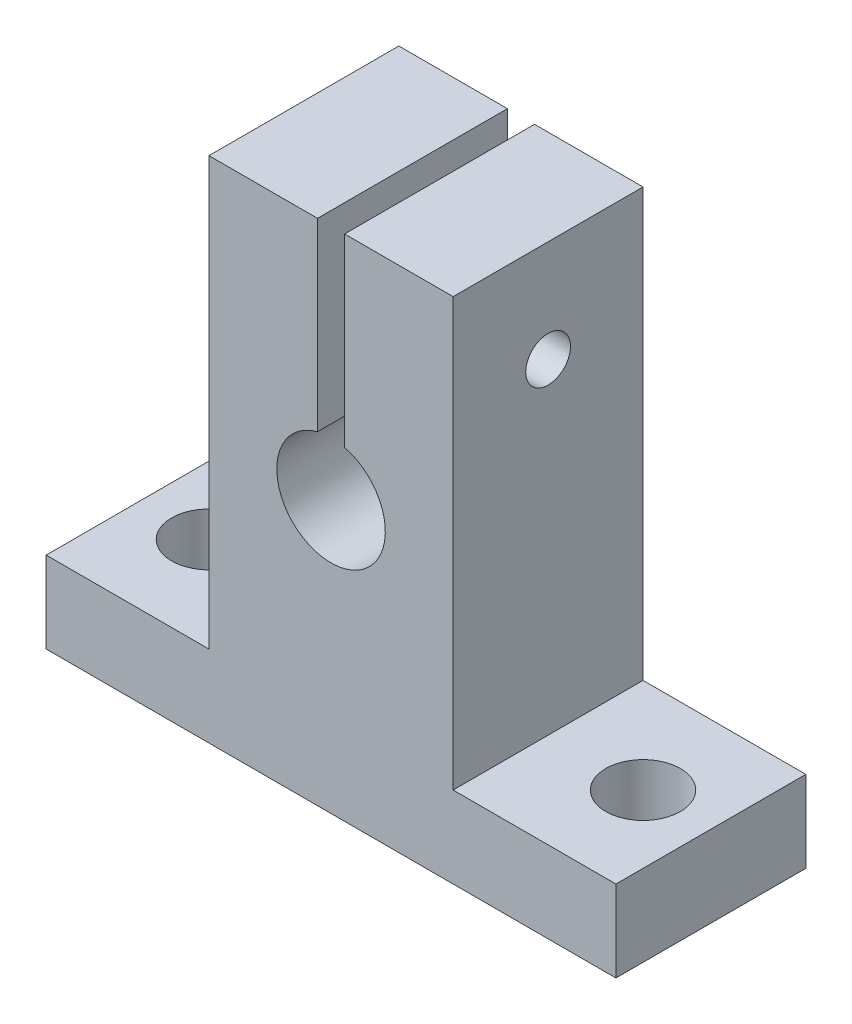
ISO-10303-21;
HEADER;
FILE_DESCRIPTION(('STEP AP214'),'2;1');
FILE_NAME('part.step','',(''),(''),'','','');
FILE_SCHEMA(('AUTOMOTIVE_DESIGN { 1 0 10303 214 1 1 1 1 }'));
ENDSEC;
DATA;
#1=APPLICATION_CONTEXT('core data for automotive mechanical design processes');
#2=APPLICATION_PROTOCOL_DEFINITION('international standard','automotive_design',2000,#1);
#3=PRODUCT_CONTEXT('',#1,'mechanical');
#4=PRODUCT('Part','Part','',(#3));
#5=PRODUCT_RELATED_PRODUCT_CATEGORY('part','',(#4));
#6=PRODUCT_DEFINITION_FORMATION('','',#4);
#7=PRODUCT_DEFINITION_CONTEXT('part definition',#1,'design');
#8=PRODUCT_DEFINITION('design','',#6,#7);
#9=PRODUCT_DEFINITION_SHAPE('','',#8);
#10=(LENGTH_UNIT() NAMED_UNIT(*) SI_UNIT(.MILLI.,.METRE.));
#11=(NAMED_UNIT(*) PLANE_ANGLE_UNIT() SI_UNIT($,.RADIAN.));
#12=(NAMED_UNIT(*) SI_UNIT($,.STERADIAN.) SOLID_ANGLE_UNIT());
#13=UNCERTAINTY_MEASURE_WITH_UNIT(LENGTH_MEASURE(1.E-05),#10,'distance_accuracy_value','');
#14=(GEOMETRIC_REPRESENTATION_CONTEXT(3) GLOBAL_UNCERTAINTY_ASSIGNED_CONTEXT((#13)) GLOBAL_UNIT_ASSIGNED_CONTEXT((#10,
#11,#12)) REPRESENTATION_CONTEXT('',''));
#15=CARTESIAN_POINT('',(0.,0.,0.));
#16=DIRECTION('',(0.,0.,1.));
#17=DIRECTION('',(1.,0.,0.));
#18=AXIS2_PLACEMENT_3D('',#15,#16,#17);
#19=CARTESIAN_POINT('',(-21.,-20.,14.));
#20=DIRECTION('',(0.,1.,0.));
#21=DIRECTION('',(0.,0.,1.));
#22=AXIS2_PLACEMENT_3D('',#19,#20,#21);
#23=PLANE('',#22);
#24=CARTESIAN_POINT('',(16.,-20.,7.));
#25=DIRECTION('',(0.,-1.,0.));
#26=DIRECTION('',(0.,0.,-1.));
#27=AXIS2_PLACEMENT_3D('',#24,#25,#26);
#28=CIRCLE('',#27,2.75);
#29=CARTESIAN_POINT('',(16.,-20.,4.25000000000001));
#30=VERTEX_POINT('',#29);
#31=EDGE_CURVE('E274',#30,#30,#28,.T.);
#32=ORIENTED_EDGE('',*,*,#31,.F.);
#33=EDGE_LOOP('',(#32));
#34=FACE_BOUND('',#33,.T.);
#35=CARTESIAN_POINT('',(-16.,-20.,7.));
#36=DIRECTION('',(0.,-1.,0.));
#37=DIRECTION('',(0.,0.,-1.));
#38=AXIS2_PLACEMENT_3D('',#35,#36,#37);
#39=CIRCLE('',#38,2.74999999999999);
#40=CARTESIAN_POINT('',(-16.,-20.,4.25000000000001));
#41=VERTEX_POINT('',#40);
#42=EDGE_CURVE('E277',#41,#41,#39,.T.);
#43=ORIENTED_EDGE('',*,*,#42,.F.);
#44=EDGE_LOOP('',(#43));
#45=FACE_BOUND('',#44,.T.);
#46=DIRECTION('',(1.,0.,0.));
#47=VECTOR('',#46,1.);
#48=CARTESIAN_POINT('',(-21.,-20.,0.));
#49=LINE('',#48,#47);
#50=CARTESIAN_POINT('',(-21.,-20.,0.));
#51=VERTEX_POINT('',#50);
#52=CARTESIAN_POINT('',(21.,-20.,0.));
#53=VERTEX_POINT('',#52);
#54=EDGE_CURVE('E122',#51,#53,#49,.T.);
#55=ORIENTED_EDGE('',*,*,#54,.T.);
#56=DIRECTION('',(0.,0.,-1.));
#57=VECTOR('',#56,1.);
#58=CARTESIAN_POINT('',(21.,-20.,14.));
#59=LINE('',#58,#57);
#60=CARTESIAN_POINT('',(21.,-20.,14.));
#61=VERTEX_POINT('',#60);
#62=EDGE_CURVE('E126',#61,#53,#59,.T.);
#63=ORIENTED_EDGE('',*,*,#62,.F.);
#64=DIRECTION('',(1.,0.,0.));
#65=VECTOR('',#64,1.);
#66=CARTESIAN_POINT('',(-21.,-20.,14.));
#67=LINE('',#66,#65);
#68=CARTESIAN_POINT('',(-21.,-20.,14.));
#69=VERTEX_POINT('',#68);
#70=EDGE_CURVE('E134',#69,#61,#67,.T.);
#71=ORIENTED_EDGE('',*,*,#70,.F.);
#72=DIRECTION('',(0.,0.,-1.));
#73=VECTOR('',#72,1.);
#74=CARTESIAN_POINT('',(-21.,-20.,14.));
#75=LINE('',#74,#73);
#76=EDGE_CURVE('E118',#69,#51,#75,.T.);
#77=ORIENTED_EDGE('',*,*,#76,.T.);
#78=EDGE_LOOP('',(#55,#63,#71,#77));
#79=FACE_BOUND('',#78,.T.);
#80=ADVANCED_FACE('F32',(#34,#45,#79),#23,.F.);
#81=CARTESIAN_POINT('',(-1.,0.,14.));
#82=DIRECTION('',(-1.,0.,0.));
#83=DIRECTION('',(0.,0.,1.));
#84=AXIS2_PLACEMENT_3D('',#81,#82,#83);
#85=PLANE('',#84);
#86=CARTESIAN_POINT('',(-0.999999999999999,10.,7.));
#87=DIRECTION('',(-1.,0.,0.));
#88=DIRECTION('',(0.,0.,1.));
#89=AXIS2_PLACEMENT_3D('',#86,#87,#88);
#90=CIRCLE('',#89,1.64999999999999);
#91=CARTESIAN_POINT('',(-0.999999999999999,10.,8.64999999999999));
#92=VERTEX_POINT('',#91);
#93=EDGE_CURVE('E147',#92,#92,#90,.T.);
#94=ORIENTED_EDGE('',*,*,#93,.T.);
#95=EDGE_LOOP('',(#94));
#96=FACE_BOUND('',#95,.T.);
#97=DIRECTION('',(0.,1.,0.));
#98=VECTOR('',#97,1.);
#99=CARTESIAN_POINT('',(-1.,0.,14.));
#100=LINE('',#99,#98);
#101=CARTESIAN_POINT('',(-1.,3.87298334620741,14.));
#102=VERTEX_POINT('',#101);
#103=CARTESIAN_POINT('',(-1.,17.5,14.));
#104=VERTEX_POINT('',#103);
#105=EDGE_CURVE('E86',#102,#104,#100,.T.);
#106=ORIENTED_EDGE('',*,*,#105,.F.);
#107=DIRECTION('',(0.,0.,-1.));
#108=VECTOR('',#107,1.);
#109=CARTESIAN_POINT('',(-1.,3.87298334620741,0.));
#110=LINE('',#109,#108);
#111=CARTESIAN_POINT('',(-1.,3.87298334620742,0.));
#112=VERTEX_POINT('',#111);
#113=EDGE_CURVE('E150',#102,#112,#110,.T.);
#114=ORIENTED_EDGE('',*,*,#113,.T.);
#115=DIRECTION('',(0.,1.,0.));
#116=VECTOR('',#115,1.);
#117=CARTESIAN_POINT('',(-1.,0.,0.));
#118=LINE('',#117,#116);
#119=CARTESIAN_POINT('',(-1.,17.5,0.));
#120=VERTEX_POINT('',#119);
#121=EDGE_CURVE('E125',#112,#120,#118,.T.);
#122=ORIENTED_EDGE('',*,*,#121,.T.);
#123=DIRECTION('',(0.,0.,-1.));
#124=VECTOR('',#123,1.);
#125=CARTESIAN_POINT('',(-1.,17.5,14.));
#126=LINE('',#125,#124);
#127=EDGE_CURVE('E40',#104,#120,#126,.T.);
#128=ORIENTED_EDGE('',*,*,#127,.F.);
#129=EDGE_LOOP('',(#106,#114,#122,#128));
#130=FACE_BOUND('',#129,.T.);
#131=ADVANCED_FACE('F264',(#96,#130),#85,.F.);
#132=CARTESIAN_POINT('',(-1.,17.5,14.));
#133=DIRECTION('',(0.,-1.,0.));
#134=DIRECTION('',(0.,0.,-1.));
#135=AXIS2_PLACEMENT_3D('',#132,#133,#134);
#136=PLANE('',#135);
#137=DIRECTION('',(-1.,0.,0.));
#138=VECTOR('',#137,1.);
#139=CARTESIAN_POINT('',(-1.,17.5,0.));
#140=LINE('',#139,#138);
#141=CARTESIAN_POINT('',(-9.,17.5,0.));
#142=VERTEX_POINT('',#141);
#143=EDGE_CURVE('E128',#120,#142,#140,.T.);
#144=ORIENTED_EDGE('',*,*,#143,.T.);
#145=DIRECTION('',(0.,0.,-1.));
#146=VECTOR('',#145,1.);
#147=CARTESIAN_POINT('',(-9.,17.5,14.));
#148=LINE('',#147,#146);
#149=CARTESIAN_POINT('',(-9.,17.5,14.));
#150=VERTEX_POINT('',#149);
#151=EDGE_CURVE('E113',#150,#142,#148,.T.);
#152=ORIENTED_EDGE('',*,*,#151,.F.);
#153=DIRECTION('',(-1.,0.,0.));
#154=VECTOR('',#153,1.);
#155=CARTESIAN_POINT('',(-1.,17.5,14.));
#156=LINE('',#155,#154);
#157=EDGE_CURVE('E101',#104,#150,#156,.T.);
#158=ORIENTED_EDGE('',*,*,#157,.F.);
#159=ORIENTED_EDGE('',*,*,#127,.T.);
#160=EDGE_LOOP('',(#144,#152,#158,#159));
#161=FACE_BOUND('',#160,.T.);
#162=ADVANCED_FACE('F269',(#161),#136,.F.);
#163=CARTESIAN_POINT('',(-9.,17.5,14.));
#164=DIRECTION('',(1.,0.,0.));
#165=DIRECTION('',(0.,1.,0.));
#166=AXIS2_PLACEMENT_3D('',#163,#164,#165);
#167=PLANE('',#166);
#168=CARTESIAN_POINT('',(-9.,10.,7.));
#169=DIRECTION('',(-1.,0.,0.));
#170=DIRECTION('',(0.,0.,1.));
#171=AXIS2_PLACEMENT_3D('',#168,#169,#170);
#172=CIRCLE('',#171,1.64999999999999);
#173=CARTESIAN_POINT('',(-9.,10.,8.64999999999999));
#174=VERTEX_POINT('',#173);
#175=EDGE_CURVE('E143',#174,#174,#172,.T.);
#176=ORIENTED_EDGE('',*,*,#175,.F.);
#177=EDGE_LOOP('',(#176));
#178=FACE_BOUND('',#177,.T.);
#179=DIRECTION('',(0.,-1.,0.));
#180=VECTOR('',#179,1.);
#181=CARTESIAN_POINT('',(-9.,17.5,0.));
#182=LINE('',#181,#180);
#183=CARTESIAN_POINT('',(-9.,-14.,0.));
#184=VERTEX_POINT('',#183);
#185=EDGE_CURVE('E110',#142,#184,#182,.T.);
#186=ORIENTED_EDGE('',*,*,#185,.T.);
#187=DIRECTION('',(0.,0.,-1.));
#188=VECTOR('',#187,1.);
#189=CARTESIAN_POINT('',(-9.,-14.,14.));
#190=LINE('',#189,#188);
#191=CARTESIAN_POINT('',(-9.,-14.,14.));
#192=VERTEX_POINT('',#191);
#193=EDGE_CURVE('E107',#192,#184,#190,.T.);
#194=ORIENTED_EDGE('',*,*,#193,.F.);
#195=DIRECTION('',(0.,-1.,0.));
#196=VECTOR('',#195,1.);
#197=CARTESIAN_POINT('',(-9.,17.5,14.));
#198=LINE('',#197,#196);
#199=EDGE_CURVE('E94',#150,#192,#198,.T.);
#200=ORIENTED_EDGE('',*,*,#199,.F.);
#201=ORIENTED_EDGE('',*,*,#151,.T.);
#202=EDGE_LOOP('',(#186,#194,#200,#201));
#203=FACE_BOUND('',#202,.T.);
#204=ADVANCED_FACE('F108',(#178,#203),#167,.F.);
#205=CARTESIAN_POINT('',(-9.,-14.,14.));
#206=DIRECTION('',(0.,-1.,0.));
#207=DIRECTION('',(1.,0.,0.));
#208=AXIS2_PLACEMENT_3D('',#205,#206,#207);
#209=PLANE('',#208);
#210=CARTESIAN_POINT('',(-16.,-14.,7.));
#211=DIRECTION('',(0.,-1.,0.));
#212=DIRECTION('',(1.,0.,0.));
#213=AXIS2_PLACEMENT_3D('',#210,#211,#212);
#214=CIRCLE('',#213,2.74999999999999);
#215=CARTESIAN_POINT('',(-13.25,-14.,7.));
#216=VERTEX_POINT('',#215);
#217=EDGE_CURVE('E279',#216,#216,#214,.T.);
#218=ORIENTED_EDGE('',*,*,#217,.T.);
#219=EDGE_LOOP('',(#218));
#220=FACE_BOUND('',#219,.T.);
#221=DIRECTION('',(-1.,0.,0.));
#222=VECTOR('',#221,1.);
#223=CARTESIAN_POINT('',(-9.,-14.,0.));
#224=LINE('',#223,#222);
#225=CARTESIAN_POINT('',(-21.,-14.,0.));
#226=VERTEX_POINT('',#225);
#227=EDGE_CURVE('E131',#184,#226,#224,.T.);
#228=ORIENTED_EDGE('',*,*,#227,.T.);
#229=DIRECTION('',(0.,0.,-1.));
#230=VECTOR('',#229,1.);
#231=CARTESIAN_POINT('',(-21.,-14.,14.));
#232=LINE('',#231,#230);
#233=CARTESIAN_POINT('',(-21.,-14.,14.));
#234=VERTEX_POINT('',#233);
#235=EDGE_CURVE('E114',#234,#226,#232,.T.);
#236=ORIENTED_EDGE('',*,*,#235,.F.);
#237=DIRECTION('',(-1.,0.,0.));
#238=VECTOR('',#237,1.);
#239=CARTESIAN_POINT('',(-9.,-14.,14.));
#240=LINE('',#239,#238);
#241=EDGE_CURVE('E98',#192,#234,#240,.T.);
#242=ORIENTED_EDGE('',*,*,#241,.F.);
#243=ORIENTED_EDGE('',*,*,#193,.T.);
#244=EDGE_LOOP('',(#228,#236,#242,#243));
#245=FACE_BOUND('',#244,.T.);
#246=ADVANCED_FACE('F116',(#220,#245),#209,.F.);
#247=CARTESIAN_POINT('',(-21.,-14.,14.));
#248=DIRECTION('',(1.,0.,0.));
#249=DIRECTION('',(0.,0.,-1.));
#250=AXIS2_PLACEMENT_3D('',#247,#248,#249);
#251=PLANE('',#250);
#252=DIRECTION('',(0.,-1.,0.));
#253=VECTOR('',#252,1.);
#254=CARTESIAN_POINT('',(-21.,-14.,0.));
#255=LINE('',#254,#253);
#256=EDGE_CURVE('E79',#226,#51,#255,.T.);
#257=ORIENTED_EDGE('',*,*,#256,.T.);
#258=ORIENTED_EDGE('',*,*,#76,.F.);
#259=DIRECTION('',(0.,-1.,0.));
#260=VECTOR('',#259,1.);
#261=CARTESIAN_POINT('',(-21.,-14.,14.));
#262=LINE('',#261,#260);
#263=EDGE_CURVE('E55',#234,#69,#262,.T.);
#264=ORIENTED_EDGE('',*,*,#263,.F.);
#265=ORIENTED_EDGE('',*,*,#235,.T.);
#266=EDGE_LOOP('',(#257,#258,#264,#265));
#267=FACE_BOUND('',#266,.T.);
#268=ADVANCED_FACE('F291',(#267),#251,.F.);
#269=CARTESIAN_POINT('',(0.,0.,14.));
#270=DIRECTION('',(0.,0.,1.));
#271=DIRECTION('',(1.,0.,0.));
#272=AXIS2_PLACEMENT_3D('',#269,#270,#271);
#273=PLANE('',#272);
#274=CARTESIAN_POINT('',(0.,0.,14.));
#275=DIRECTION('',(0.,0.,-1.));
#276=DIRECTION('',(-1.,0.,0.));
#277=AXIS2_PLACEMENT_3D('',#274,#275,#276);
#278=CIRCLE('',#277,4.);
#279=CARTESIAN_POINT('',(1.,3.87298334620741,14.));
#280=VERTEX_POINT('',#279);
#281=EDGE_CURVE('E46',#280,#102,#278,.T.);
#282=ORIENTED_EDGE('',*,*,#281,.T.);
#283=ORIENTED_EDGE('',*,*,#105,.T.);
#284=ORIENTED_EDGE('',*,*,#157,.T.);
#285=ORIENTED_EDGE('',*,*,#199,.T.);
#286=ORIENTED_EDGE('',*,*,#241,.T.);
#287=ORIENTED_EDGE('',*,*,#263,.T.);
#288=ORIENTED_EDGE('',*,*,#70,.T.);
#289=DIRECTION('',(0.,-1.,0.));
#290=VECTOR('',#289,1.);
#291=CARTESIAN_POINT('',(21.,-14.,14.));
#292=LINE('',#291,#290);
#293=CARTESIAN_POINT('',(21.,-14.,14.));
#294=VERTEX_POINT('',#293);
#295=EDGE_CURVE('E161',#294,#61,#292,.T.);
#296=ORIENTED_EDGE('',*,*,#295,.F.);
#297=DIRECTION('',(1.,0.,0.));
#298=VECTOR('',#297,1.);
#299=CARTESIAN_POINT('',(9.,-14.,14.));
#300=LINE('',#299,#298);
#301=CARTESIAN_POINT('',(9.,-14.,14.));
#302=VERTEX_POINT('',#301);
#303=EDGE_CURVE('E164',#302,#294,#300,.T.);
#304=ORIENTED_EDGE('',*,*,#303,.F.);
#305=DIRECTION('',(0.,-1.,0.));
#306=VECTOR('',#305,1.);
#307=CARTESIAN_POINT('',(9.,17.5,14.));
#308=LINE('',#307,#306);
#309=CARTESIAN_POINT('',(9.,17.5,14.));
#310=VERTEX_POINT('',#309);
#311=EDGE_CURVE('E168',#310,#302,#308,.T.);
#312=ORIENTED_EDGE('',*,*,#311,.F.);
#313=DIRECTION('',(1.,0.,0.));
#314=VECTOR('',#313,1.);
#315=CARTESIAN_POINT('',(1.,17.5,14.));
#316=LINE('',#315,#314);
#317=CARTESIAN_POINT('',(1.,17.5,14.));
#318=VERTEX_POINT('',#317);
#319=EDGE_CURVE('E171',#318,#310,#316,.T.);
#320=ORIENTED_EDGE('',*,*,#319,.F.);
#321=DIRECTION('',(0.,1.,0.));
#322=VECTOR('',#321,1.);
#323=CARTESIAN_POINT('',(1.,0.,14.));
#324=LINE('',#323,#322);
#325=EDGE_CURVE('E174',#280,#318,#324,.T.);
#326=ORIENTED_EDGE('',*,*,#325,.F.);
#327=EDGE_LOOP('',(#282,#283,#284,#285,#286,#287,#288,#296,#304,#312,#320,#326));
#328=FACE_BOUND('',#327,.T.);
#329=ADVANCED_FACE('F96',(#328),#273,.T.);
#330=CARTESIAN_POINT('',(0.,0.,0.));
#331=DIRECTION('',(0.,0.,1.));
#332=DIRECTION('',(1.,0.,0.));
#333=AXIS2_PLACEMENT_3D('',#330,#331,#332);
#334=PLANE('',#333);
#335=ORIENTED_EDGE('',*,*,#121,.F.);
#336=CARTESIAN_POINT('',(0.,0.,0.));
#337=DIRECTION('',(0.,0.,-1.));
#338=DIRECTION('',(-1.,0.,0.));
#339=AXIS2_PLACEMENT_3D('',#336,#337,#338);
#340=CIRCLE('',#339,4.);
#341=CARTESIAN_POINT('',(1.,3.87298334620742,0.));
#342=VERTEX_POINT('',#341);
#343=EDGE_CURVE('E244',#342,#112,#340,.T.);
#344=ORIENTED_EDGE('',*,*,#343,.F.);
#345=DIRECTION('',(0.,1.,0.));
#346=VECTOR('',#345,1.);
#347=CARTESIAN_POINT('',(1.,0.,0.));
#348=LINE('',#347,#346);
#349=CARTESIAN_POINT('',(1.,17.5,0.));
#350=VERTEX_POINT('',#349);
#351=EDGE_CURVE('E165',#342,#350,#348,.T.);
#352=ORIENTED_EDGE('',*,*,#351,.T.);
#353=DIRECTION('',(1.,0.,0.));
#354=VECTOR('',#353,1.);
#355=CARTESIAN_POINT('',(1.,17.5,0.));
#356=LINE('',#355,#354);
#357=CARTESIAN_POINT('',(9.,17.5,0.));
#358=VERTEX_POINT('',#357);
#359=EDGE_CURVE('E186',#350,#358,#356,.T.);
#360=ORIENTED_EDGE('',*,*,#359,.T.);
#361=DIRECTION('',(0.,-1.,0.));
#362=VECTOR('',#361,1.);
#363=CARTESIAN_POINT('',(9.,17.5,0.));
#364=LINE('',#363,#362);
#365=CARTESIAN_POINT('',(9.,-14.,0.));
#366=VERTEX_POINT('',#365);
#367=EDGE_CURVE('E183',#358,#366,#364,.T.);
#368=ORIENTED_EDGE('',*,*,#367,.T.);
#369=DIRECTION('',(1.,0.,0.));
#370=VECTOR('',#369,1.);
#371=CARTESIAN_POINT('',(9.,-14.,0.));
#372=LINE('',#371,#370);
#373=CARTESIAN_POINT('',(21.,-14.,0.));
#374=VERTEX_POINT('',#373);
#375=EDGE_CURVE('E180',#366,#374,#372,.T.);
#376=ORIENTED_EDGE('',*,*,#375,.T.);
#377=DIRECTION('',(0.,-1.,0.));
#378=VECTOR('',#377,1.);
#379=CARTESIAN_POINT('',(21.,-14.,0.));
#380=LINE('',#379,#378);
#381=EDGE_CURVE('E160',#374,#53,#380,.T.);
#382=ORIENTED_EDGE('',*,*,#381,.T.);
#383=ORIENTED_EDGE('',*,*,#54,.F.);
#384=ORIENTED_EDGE('',*,*,#256,.F.);
#385=ORIENTED_EDGE('',*,*,#227,.F.);
#386=ORIENTED_EDGE('',*,*,#185,.F.);
#387=ORIENTED_EDGE('',*,*,#143,.F.);
#388=EDGE_LOOP('',(#335,#344,#352,#360,#368,#376,#382,#383,#384,#385,#386,#387));
#389=FACE_BOUND('',#388,.T.);
#390=ADVANCED_FACE('F241',(#389),#334,.F.);
#391=CARTESIAN_POINT('',(21.,-14.,14.));
#392=DIRECTION('',(1.,0.,0.));
#393=DIRECTION('',(0.,0.,-1.));
#394=AXIS2_PLACEMENT_3D('',#391,#392,#393);
#395=PLANE('',#394);
#396=ORIENTED_EDGE('',*,*,#381,.F.);
#397=DIRECTION('',(0.,0.,-1.));
#398=VECTOR('',#397,1.);
#399=CARTESIAN_POINT('',(21.,-14.,14.));
#400=LINE('',#399,#398);
#401=EDGE_CURVE('E199',#294,#374,#400,.T.);
#402=ORIENTED_EDGE('',*,*,#401,.F.);
#403=ORIENTED_EDGE('',*,*,#295,.T.);
#404=ORIENTED_EDGE('',*,*,#62,.T.);
#405=EDGE_LOOP('',(#396,#402,#403,#404));
#406=FACE_BOUND('',#405,.T.);
#407=ADVANCED_FACE('F218',(#406),#395,.T.);
#408=CARTESIAN_POINT('',(9.,-14.,14.));
#409=DIRECTION('',(0.,1.,0.));
#410=DIRECTION('',(-1.,0.,0.));
#411=AXIS2_PLACEMENT_3D('',#408,#409,#410);
#412=PLANE('',#411);
#413=CARTESIAN_POINT('',(16.,-14.,7.));
#414=DIRECTION('',(0.,1.,0.));
#415=DIRECTION('',(-1.,0.,0.));
#416=AXIS2_PLACEMENT_3D('',#413,#414,#415);
#417=CIRCLE('',#416,2.74999999999999);
#418=CARTESIAN_POINT('',(13.25,-14.,7.));
#419=VERTEX_POINT('',#418);
#420=EDGE_CURVE('E35',#419,#419,#417,.T.);
#421=ORIENTED_EDGE('',*,*,#420,.F.);
#422=EDGE_LOOP('',(#421));
#423=FACE_BOUND('',#422,.T.);
#424=ORIENTED_EDGE('',*,*,#375,.F.);
#425=DIRECTION('',(0.,0.,-1.));
#426=VECTOR('',#425,1.);
#427=CARTESIAN_POINT('',(9.,-14.,14.));
#428=LINE('',#427,#426);
#429=EDGE_CURVE('E196',#302,#366,#428,.T.);
#430=ORIENTED_EDGE('',*,*,#429,.F.);
#431=ORIENTED_EDGE('',*,*,#303,.T.);
#432=ORIENTED_EDGE('',*,*,#401,.T.);
#433=EDGE_LOOP('',(#424,#430,#431,#432));
#434=FACE_BOUND('',#433,.T.);
#435=ADVANCED_FACE('F224',(#423,#434),#412,.T.);
#436=CARTESIAN_POINT('',(9.,17.5,14.));
#437=DIRECTION('',(1.,0.,0.));
#438=DIRECTION('',(0.,1.,0.));
#439=AXIS2_PLACEMENT_3D('',#436,#437,#438);
#440=PLANE('',#439);
#441=CARTESIAN_POINT('',(9.,10.,7.));
#442=DIRECTION('',(1.,0.,0.));
#443=DIRECTION('',(0.,1.,0.));
#444=AXIS2_PLACEMENT_3D('',#441,#442,#443);
#445=CIRCLE('',#444,1.64999999999999);
#446=CARTESIAN_POINT('',(9.,11.65,7.));
#447=VERTEX_POINT('',#446);
#448=EDGE_CURVE('E142',#447,#447,#445,.T.);
#449=ORIENTED_EDGE('',*,*,#448,.F.);
#450=EDGE_LOOP('',(#449));
#451=FACE_BOUND('',#450,.T.);
#452=ORIENTED_EDGE('',*,*,#367,.F.);
#453=DIRECTION('',(0.,0.,-1.));
#454=VECTOR('',#453,1.);
#455=CARTESIAN_POINT('',(9.,17.5,14.));
#456=LINE('',#455,#454);
#457=EDGE_CURVE('E193',#310,#358,#456,.T.);
#458=ORIENTED_EDGE('',*,*,#457,.F.);
#459=ORIENTED_EDGE('',*,*,#311,.T.);
#460=ORIENTED_EDGE('',*,*,#429,.T.);
#461=EDGE_LOOP('',(#452,#458,#459,#460));
#462=FACE_BOUND('',#461,.T.);
#463=ADVANCED_FACE('F253',(#451,#462),#440,.T.);
#464=CARTESIAN_POINT('',(1.,17.5,14.));
#465=DIRECTION('',(0.,1.,0.));
#466=DIRECTION('',(0.,0.,1.));
#467=AXIS2_PLACEMENT_3D('',#464,#465,#466);
#468=PLANE('',#467);
#469=ORIENTED_EDGE('',*,*,#359,.F.);
#470=DIRECTION('',(0.,0.,-1.));
#471=VECTOR('',#470,1.);
#472=CARTESIAN_POINT('',(1.,17.5,14.));
#473=LINE('',#472,#471);
#474=EDGE_CURVE('E177',#318,#350,#473,.T.);
#475=ORIENTED_EDGE('',*,*,#474,.F.);
#476=ORIENTED_EDGE('',*,*,#319,.T.);
#477=ORIENTED_EDGE('',*,*,#457,.T.);
#478=EDGE_LOOP('',(#469,#475,#476,#477));
#479=FACE_BOUND('',#478,.T.);
#480=ADVANCED_FACE('F251',(#479),#468,.T.);
#481=CARTESIAN_POINT('',(1.,0.,14.));
#482=DIRECTION('',(-1.,0.,0.));
#483=DIRECTION('',(0.,0.,1.));
#484=AXIS2_PLACEMENT_3D('',#481,#482,#483);
#485=PLANE('',#484);
#486=DIRECTION('',(0.,0.,-1.));
#487=VECTOR('',#486,1.);
#488=CARTESIAN_POINT('',(1.,3.87298334620741,0.));
#489=LINE('',#488,#487);
#490=EDGE_CURVE('E11',#280,#342,#489,.T.);
#491=ORIENTED_EDGE('',*,*,#490,.F.);
#492=ORIENTED_EDGE('',*,*,#325,.T.);
#493=ORIENTED_EDGE('',*,*,#474,.T.);
#494=ORIENTED_EDGE('',*,*,#351,.F.);
#495=EDGE_LOOP('',(#491,#492,#493,#494));
#496=FACE_BOUND('',#495,.T.);
#497=CARTESIAN_POINT('',(0.999999999999999,10.,7.));
#498=DIRECTION('',(-1.,0.,0.));
#499=DIRECTION('',(0.,0.,1.));
#500=AXIS2_PLACEMENT_3D('',#497,#498,#499);
#501=CIRCLE('',#500,1.64999999999999);
#502=CARTESIAN_POINT('',(0.999999999999999,10.,8.64999999999999));
#503=VERTEX_POINT('',#502);
#504=EDGE_CURVE('E140',#503,#503,#501,.T.);
#505=ORIENTED_EDGE('',*,*,#504,.F.);
#506=EDGE_LOOP('',(#505));
#507=FACE_BOUND('',#506,.T.);
#508=ADVANCED_FACE('F247',(#496,#507),#485,.T.);
#509=CARTESIAN_POINT('',(-9.,10.,7.));
#510=DIRECTION('',(-1.,0.,0.));
#511=DIRECTION('',(0.,0.,1.));
#512=AXIS2_PLACEMENT_3D('',#509,#510,#511);
#513=CYLINDRICAL_SURFACE('',#512,1.64999999999999);
#514=ORIENTED_EDGE('',*,*,#448,.T.);
#515=EDGE_LOOP('',(#514));
#516=FACE_BOUND('',#515,.T.);
#517=ORIENTED_EDGE('',*,*,#504,.T.);
#518=EDGE_LOOP('',(#517));
#519=FACE_BOUND('',#518,.T.);
#520=ADVANCED_FACE('F259',(#516,#519),#513,.F.);
#521=ORIENTED_EDGE('',*,*,#175,.T.);
#522=EDGE_LOOP('',(#521));
#523=FACE_BOUND('',#522,.T.);
#524=ORIENTED_EDGE('',*,*,#93,.F.);
#525=EDGE_LOOP('',(#524));
#526=FACE_BOUND('',#525,.T.);
#527=ADVANCED_FACE('F302',(#523,#526),#513,.F.);
#528=CARTESIAN_POINT('',(0.,0.,0.));
#529=DIRECTION('',(0.,0.,-1.));
#530=DIRECTION('',(-1.,0.,0.));
#531=AXIS2_PLACEMENT_3D('',#528,#529,#530);
#532=CYLINDRICAL_SURFACE('',#531,4.);
#533=ORIENTED_EDGE('',*,*,#281,.F.);
#534=ORIENTED_EDGE('',*,*,#490,.T.);
#535=ORIENTED_EDGE('',*,*,#343,.T.);
#536=ORIENTED_EDGE('',*,*,#113,.F.);
#537=EDGE_LOOP('',(#533,#534,#535,#536));
#538=FACE_BOUND('',#537,.T.);
#539=ADVANCED_FACE('F299',(#538),#532,.F.);
#540=CARTESIAN_POINT('',(-16.,-20.,7.));
#541=DIRECTION('',(0.,-1.,0.));
#542=DIRECTION('',(0.,0.,-1.));
#543=AXIS2_PLACEMENT_3D('',#540,#541,#542);
#544=CYLINDRICAL_SURFACE('',#543,2.74999999999999);
#545=ORIENTED_EDGE('',*,*,#42,.T.);
#546=EDGE_LOOP('',(#545));
#547=FACE_BOUND('',#546,.T.);
#548=ORIENTED_EDGE('',*,*,#217,.F.);
#549=EDGE_LOOP('',(#548));
#550=FACE_BOUND('',#549,.T.);
#551=ADVANCED_FACE('F301',(#547,#550),#544,.F.);
#552=CARTESIAN_POINT('',(16.,-20.,7.));
#553=DIRECTION('',(0.,-1.,0.));
#554=DIRECTION('',(0.,0.,-1.));
#555=AXIS2_PLACEMENT_3D('',#552,#553,#554);
#556=CYLINDRICAL_SURFACE('',#555,2.74999999999999);
#557=ORIENTED_EDGE('',*,*,#420,.T.);
#558=EDGE_LOOP('',(#557));
#559=FACE_BOUND('',#558,.T.);
#560=ORIENTED_EDGE('',*,*,#31,.T.);
#561=EDGE_LOOP('',(#560));
#562=FACE_BOUND('',#561,.T.);
#563=ADVANCED_FACE('F308',(#559,#562),#556,.F.);
#564=CLOSED_SHELL('',(#80,#131,#162,#204,#246,#268,#329,#390,#407,#435,#463,#480,#508,#520,#527,
#539,#551,#563));
#565=MANIFOLD_SOLID_BREP('B2',#564);
#566=ADVANCED_BREP_SHAPE_REPRESENTATION('',(#18,#565),#14);
#567=SHAPE_DEFINITION_REPRESENTATION(#9,#566);
ENDSEC;
END-ISO-10303-21;
